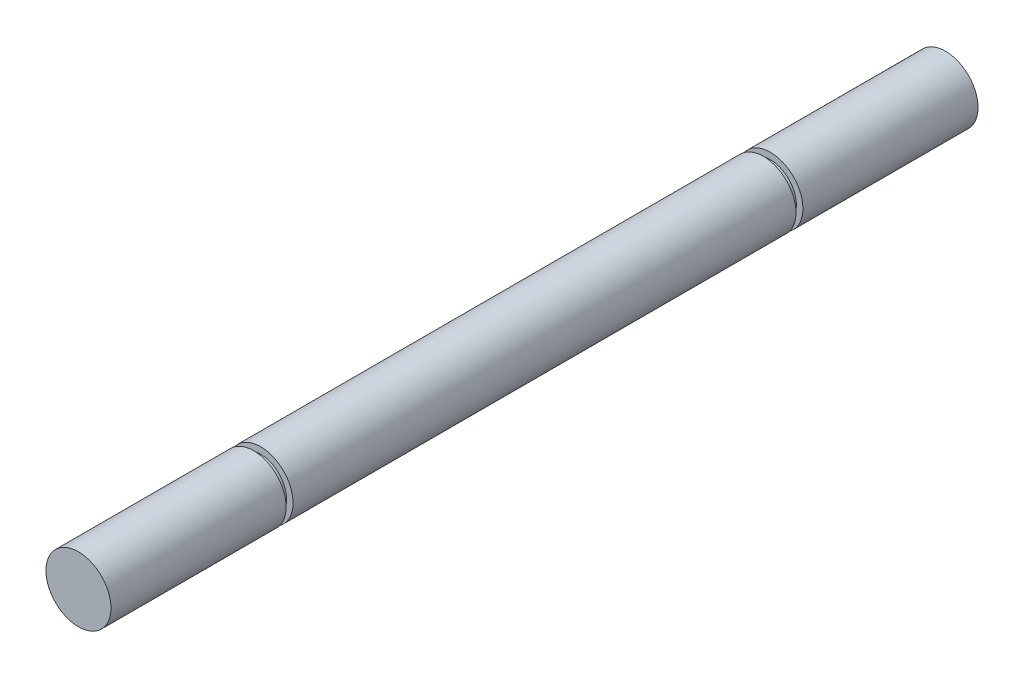
ISO-10303-21;
HEADER;
FILE_DESCRIPTION(('STEP AP214'),'2;1');
FILE_NAME('part.step','',(''),(''),'','','');
FILE_SCHEMA(('AUTOMOTIVE_DESIGN { 1 0 10303 214 1 1 1 1 }'));
ENDSEC;
DATA;
#1=APPLICATION_CONTEXT('core data for automotive mechanical design processes');
#2=APPLICATION_PROTOCOL_DEFINITION('international standard','automotive_design',2000,#1);
#3=PRODUCT_CONTEXT('',#1,'mechanical');
#4=PRODUCT('Part','Part','',(#3));
#5=PRODUCT_RELATED_PRODUCT_CATEGORY('part','',(#4));
#6=PRODUCT_DEFINITION_FORMATION('','',#4);
#7=PRODUCT_DEFINITION_CONTEXT('part definition',#1,'design');
#8=PRODUCT_DEFINITION('design','',#6,#7);
#9=PRODUCT_DEFINITION_SHAPE('','',#8);
#10=(LENGTH_UNIT() NAMED_UNIT(*) SI_UNIT(.MILLI.,.METRE.));
#11=(NAMED_UNIT(*) PLANE_ANGLE_UNIT() SI_UNIT($,.RADIAN.));
#12=(NAMED_UNIT(*) SI_UNIT($,.STERADIAN.) SOLID_ANGLE_UNIT());
#13=UNCERTAINTY_MEASURE_WITH_UNIT(LENGTH_MEASURE(1.E-05),#10,'distance_accuracy_value','');
#14=(GEOMETRIC_REPRESENTATION_CONTEXT(3) GLOBAL_UNCERTAINTY_ASSIGNED_CONTEXT((#13)) GLOBAL_UNIT_ASSIGNED_CONTEXT((#10,
#11,#12)) REPRESENTATION_CONTEXT('',''));
#15=CARTESIAN_POINT('',(0.,0.,0.));
#16=DIRECTION('',(0.,0.,1.));
#17=DIRECTION('',(1.,0.,0.));
#18=AXIS2_PLACEMENT_3D('',#15,#16,#17);
#19=CARTESIAN_POINT('',(0.,0.,73.66));
#20=DIRECTION('',(0.,0.,-1.));
#21=DIRECTION('',(-1.,0.,0.));
#22=AXIS2_PLACEMENT_3D('',#19,#20,#21);
#23=CYLINDRICAL_SURFACE('',#22,4.7625);
#24=CARTESIAN_POINT('',(0.,0.,73.66));
#25=DIRECTION('',(0.,0.,1.));
#26=DIRECTION('',(1.,0.,0.));
#27=AXIS2_PLACEMENT_3D('',#24,#25,#26);
#28=CIRCLE('',#27,4.7625);
#29=CARTESIAN_POINT('',(4.7625,0.,73.66));
#30=VERTEX_POINT('',#29);
#31=EDGE_CURVE('E50',#30,#30,#28,.T.);
#32=ORIENTED_EDGE('',*,*,#31,.F.);
#33=EDGE_LOOP('',(#32));
#34=FACE_BOUND('',#33,.T.);
#35=CARTESIAN_POINT('',(0.,0.,0.));
#36=DIRECTION('',(0.,0.,1.));
#37=DIRECTION('',(1.,0.,0.));
#38=AXIS2_PLACEMENT_3D('',#35,#36,#37);
#39=CIRCLE('',#38,4.7625);
#40=CARTESIAN_POINT('',(4.7625,0.,0.));
#41=VERTEX_POINT('',#40);
#42=EDGE_CURVE('E41',#41,#41,#39,.T.);
#43=ORIENTED_EDGE('',*,*,#42,.T.);
#44=EDGE_LOOP('',(#43));
#45=FACE_BOUND('',#44,.T.);
#46=ADVANCED_FACE('F38',(#34,#45),#23,.T.);
#47=CARTESIAN_POINT('',(0.,0.,73.66));
#48=DIRECTION('',(0.,0.,1.));
#49=DIRECTION('',(1.,0.,0.));
#50=AXIS2_PLACEMENT_3D('',#47,#48,#49);
#51=PLANE('',#50);
#52=CARTESIAN_POINT('',(0.,0.,73.66));
#53=DIRECTION('',(0.,0.,1.));
#54=DIRECTION('',(1.,0.,0.));
#55=AXIS2_PLACEMENT_3D('',#52,#53,#54);
#56=CIRCLE('',#55,3.81);
#57=CARTESIAN_POINT('',(3.81,0.,73.66));
#58=VERTEX_POINT('',#57);
#59=EDGE_CURVE('E10',#58,#58,#56,.T.);
#60=ORIENTED_EDGE('',*,*,#59,.F.);
#61=EDGE_LOOP('',(#60));
#62=FACE_BOUND('',#61,.T.);
#63=ORIENTED_EDGE('',*,*,#31,.T.);
#64=EDGE_LOOP('',(#63));
#65=FACE_BOUND('',#64,.T.);
#66=ADVANCED_FACE('F74',(#62,#65),#51,.T.);
#67=CARTESIAN_POINT('',(0.,0.,0.));
#68=DIRECTION('',(0.,0.,1.));
#69=DIRECTION('',(1.,0.,0.));
#70=AXIS2_PLACEMENT_3D('',#67,#68,#69);
#71=PLANE('',#70);
#72=CARTESIAN_POINT('',(0.,0.,0.));
#73=DIRECTION('',(0.,0.,-1.));
#74=DIRECTION('',(-1.,0.,0.));
#75=AXIS2_PLACEMENT_3D('',#72,#73,#74);
#76=CIRCLE('',#75,3.81);
#77=CARTESIAN_POINT('',(-3.81,0.,0.));
#78=VERTEX_POINT('',#77);
#79=EDGE_CURVE('E45',#78,#78,#76,.T.);
#80=ORIENTED_EDGE('',*,*,#79,.F.);
#81=EDGE_LOOP('',(#80));
#82=FACE_BOUND('',#81,.T.);
#83=ORIENTED_EDGE('',*,*,#42,.F.);
#84=EDGE_LOOP('',(#83));
#85=FACE_BOUND('',#84,.T.);
#86=ADVANCED_FACE('F71',(#82,#85),#71,.F.);
#87=CARTESIAN_POINT('',(0.,0.,-1.016));
#88=DIRECTION('',(0.,0.,1.));
#89=DIRECTION('',(1.,0.,0.));
#90=AXIS2_PLACEMENT_3D('',#87,#88,#89);
#91=CYLINDRICAL_SURFACE('',#90,3.81);
#92=CARTESIAN_POINT('',(0.,0.,-1.016));
#93=DIRECTION('',(0.,0.,-1.));
#94=DIRECTION('',(-1.,0.,0.));
#95=AXIS2_PLACEMENT_3D('',#92,#93,#94);
#96=CIRCLE('',#95,3.81);
#97=CARTESIAN_POINT('',(-3.81,0.,-1.016));
#98=VERTEX_POINT('',#97);
#99=EDGE_CURVE('E59',#98,#98,#96,.T.);
#100=ORIENTED_EDGE('',*,*,#99,.F.);
#101=EDGE_LOOP('',(#100));
#102=FACE_BOUND('',#101,.T.);
#103=ORIENTED_EDGE('',*,*,#79,.T.);
#104=EDGE_LOOP('',(#103));
#105=FACE_BOUND('',#104,.T.);
#106=ADVANCED_FACE('F73',(#102,#105),#91,.T.);
#107=CARTESIAN_POINT('',(0.,0.,-26.67));
#108=DIRECTION('',(0.,0.,1.));
#109=DIRECTION('',(1.,0.,0.));
#110=AXIS2_PLACEMENT_3D('',#107,#108,#109);
#111=CYLINDRICAL_SURFACE('',#110,4.7625);
#112=CARTESIAN_POINT('',(0.,0.,-26.67));
#113=DIRECTION('',(0.,0.,-1.));
#114=DIRECTION('',(-1.,0.,0.));
#115=AXIS2_PLACEMENT_3D('',#112,#113,#114);
#116=CIRCLE('',#115,4.7625);
#117=CARTESIAN_POINT('',(-4.7625,0.,-26.67));
#118=VERTEX_POINT('',#117);
#119=EDGE_CURVE('E56',#118,#118,#116,.T.);
#120=ORIENTED_EDGE('',*,*,#119,.F.);
#121=EDGE_LOOP('',(#120));
#122=FACE_BOUND('',#121,.T.);
#123=CARTESIAN_POINT('',(0.,0.,-1.016));
#124=DIRECTION('',(0.,0.,-1.));
#125=DIRECTION('',(-1.,0.,0.));
#126=AXIS2_PLACEMENT_3D('',#123,#124,#125);
#127=CIRCLE('',#126,4.7625);
#128=CARTESIAN_POINT('',(-4.7625,0.,-1.016));
#129=VERTEX_POINT('',#128);
#130=EDGE_CURVE('E60',#129,#129,#127,.T.);
#131=ORIENTED_EDGE('',*,*,#130,.T.);
#132=EDGE_LOOP('',(#131));
#133=FACE_BOUND('',#132,.T.);
#134=ADVANCED_FACE('F80',(#122,#133),#111,.T.);
#135=CARTESIAN_POINT('',(0.,0.,-26.67));
#136=DIRECTION('',(0.,0.,-1.));
#137=DIRECTION('',(-1.,0.,0.));
#138=AXIS2_PLACEMENT_3D('',#135,#136,#137);
#139=PLANE('',#138);
#140=ORIENTED_EDGE('',*,*,#119,.T.);
#141=EDGE_LOOP('',(#140));
#142=FACE_BOUND('',#141,.T.);
#143=ADVANCED_FACE('F118',(#142),#139,.T.);
#144=CARTESIAN_POINT('',(0.,0.,-1.016));
#145=DIRECTION('',(0.,0.,-1.));
#146=DIRECTION('',(-1.,0.,0.));
#147=AXIS2_PLACEMENT_3D('',#144,#145,#146);
#148=PLANE('',#147);
#149=ORIENTED_EDGE('',*,*,#99,.T.);
#150=EDGE_LOOP('',(#149));
#151=FACE_BOUND('',#150,.T.);
#152=ORIENTED_EDGE('',*,*,#130,.F.);
#153=EDGE_LOOP('',(#152));
#154=FACE_BOUND('',#153,.T.);
#155=ADVANCED_FACE('F128',(#151,#154),#148,.F.);
#156=CARTESIAN_POINT('',(0.,0.,74.676));
#157=DIRECTION('',(0.,0.,-1.));
#158=DIRECTION('',(-1.,0.,0.));
#159=AXIS2_PLACEMENT_3D('',#156,#157,#158);
#160=CYLINDRICAL_SURFACE('',#159,3.81);
#161=CARTESIAN_POINT('',(0.,0.,74.676));
#162=DIRECTION('',(0.,0.,1.));
#163=DIRECTION('',(1.,0.,0.));
#164=AXIS2_PLACEMENT_3D('',#161,#162,#163);
#165=CIRCLE('',#164,3.81);
#166=CARTESIAN_POINT('',(3.81,0.,74.676));
#167=VERTEX_POINT('',#166);
#168=EDGE_CURVE('E54',#167,#167,#165,.T.);
#169=ORIENTED_EDGE('',*,*,#168,.F.);
#170=EDGE_LOOP('',(#169));
#171=FACE_BOUND('',#170,.T.);
#172=ORIENTED_EDGE('',*,*,#59,.T.);
#173=EDGE_LOOP('',(#172));
#174=FACE_BOUND('',#173,.T.);
#175=ADVANCED_FACE('F137',(#171,#174),#160,.T.);
#176=CARTESIAN_POINT('',(0.,0.,100.33));
#177=DIRECTION('',(0.,0.,-1.));
#178=DIRECTION('',(-1.,0.,0.));
#179=AXIS2_PLACEMENT_3D('',#176,#177,#178);
#180=CYLINDRICAL_SURFACE('',#179,4.7625);
#181=CARTESIAN_POINT('',(0.,0.,100.33));
#182=DIRECTION('',(0.,0.,1.));
#183=DIRECTION('',(1.,0.,0.));
#184=AXIS2_PLACEMENT_3D('',#181,#182,#183);
#185=CIRCLE('',#184,4.7625);
#186=CARTESIAN_POINT('',(4.7625,0.,100.33));
#187=VERTEX_POINT('',#186);
#188=EDGE_CURVE('E186',#187,#187,#185,.T.);
#189=ORIENTED_EDGE('',*,*,#188,.F.);
#190=EDGE_LOOP('',(#189));
#191=FACE_BOUND('',#190,.T.);
#192=CARTESIAN_POINT('',(0.,0.,74.676));
#193=DIRECTION('',(0.,0.,1.));
#194=DIRECTION('',(1.,0.,0.));
#195=AXIS2_PLACEMENT_3D('',#192,#193,#194);
#196=CIRCLE('',#195,4.7625);
#197=CARTESIAN_POINT('',(4.7625,0.,74.676));
#198=VERTEX_POINT('',#197);
#199=EDGE_CURVE('E184',#198,#198,#196,.T.);
#200=ORIENTED_EDGE('',*,*,#199,.T.);
#201=EDGE_LOOP('',(#200));
#202=FACE_BOUND('',#201,.T.);
#203=ADVANCED_FACE('F146',(#191,#202),#180,.T.);
#204=CARTESIAN_POINT('',(0.,0.,100.33));
#205=DIRECTION('',(0.,0.,1.));
#206=DIRECTION('',(1.,0.,0.));
#207=AXIS2_PLACEMENT_3D('',#204,#205,#206);
#208=PLANE('',#207);
#209=ORIENTED_EDGE('',*,*,#188,.T.);
#210=EDGE_LOOP('',(#209));
#211=FACE_BOUND('',#210,.T.);
#212=ADVANCED_FACE('F156',(#211),#208,.T.);
#213=CARTESIAN_POINT('',(0.,0.,74.676));
#214=DIRECTION('',(0.,0.,1.));
#215=DIRECTION('',(1.,0.,0.));
#216=AXIS2_PLACEMENT_3D('',#213,#214,#215);
#217=PLANE('',#216);
#218=ORIENTED_EDGE('',*,*,#168,.T.);
#219=EDGE_LOOP('',(#218));
#220=FACE_BOUND('',#219,.T.);
#221=ORIENTED_EDGE('',*,*,#199,.F.);
#222=EDGE_LOOP('',(#221));
#223=FACE_BOUND('',#222,.T.);
#224=ADVANCED_FACE('F166',(#220,#223),#217,.F.);
#225=CLOSED_SHELL('',(#46,#66,#86,#106,#134,#143,#155,#175,#203,#212,#224));
#226=MANIFOLD_SOLID_BREP('B2',#225);
#227=ADVANCED_BREP_SHAPE_REPRESENTATION('',(#18,#226),#14);
#228=SHAPE_DEFINITION_REPRESENTATION(#9,#227);
ENDSEC;
END-ISO-10303-21;
